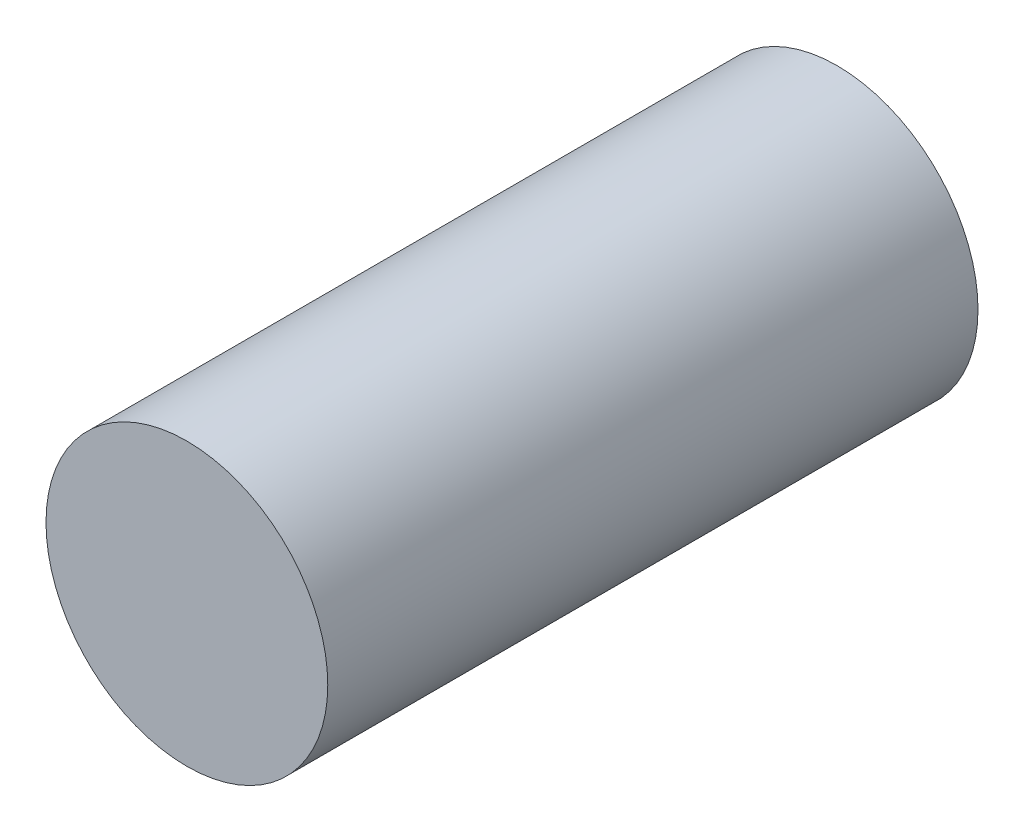
ISO-10303-21;
HEADER;
FILE_DESCRIPTION(('STEP AP214'),'2;1');
FILE_NAME('part.step','',(''),(''),'','','');
FILE_SCHEMA(('AUTOMOTIVE_DESIGN { 1 0 10303 214 1 1 1 1 }'));
ENDSEC;
DATA;
#1=APPLICATION_CONTEXT('core data for automotive mechanical design processes');
#2=APPLICATION_PROTOCOL_DEFINITION('international standard','automotive_design',2000,#1);
#3=PRODUCT_CONTEXT('',#1,'mechanical');
#4=PRODUCT('Part','Part','',(#3));
#5=PRODUCT_RELATED_PRODUCT_CATEGORY('part','',(#4));
#6=PRODUCT_DEFINITION_FORMATION('','',#4);
#7=PRODUCT_DEFINITION_CONTEXT('part definition',#1,'design');
#8=PRODUCT_DEFINITION('design','',#6,#7);
#9=PRODUCT_DEFINITION_SHAPE('','',#8);
#10=(LENGTH_UNIT() NAMED_UNIT(*) SI_UNIT(.MILLI.,.METRE.));
#11=(NAMED_UNIT(*) PLANE_ANGLE_UNIT() SI_UNIT($,.RADIAN.));
#12=(NAMED_UNIT(*) SI_UNIT($,.STERADIAN.) SOLID_ANGLE_UNIT());
#13=UNCERTAINTY_MEASURE_WITH_UNIT(LENGTH_MEASURE(1.E-05),#10,'distance_accuracy_value','');
#14=(GEOMETRIC_REPRESENTATION_CONTEXT(3) GLOBAL_UNCERTAINTY_ASSIGNED_CONTEXT((#13)) GLOBAL_UNIT_ASSIGNED_CONTEXT((#10,
#11,#12)) REPRESENTATION_CONTEXT('',''));
#15=CARTESIAN_POINT('',(0.,0.,0.));
#16=DIRECTION('',(0.,0.,1.));
#17=DIRECTION('',(1.,0.,0.));
#18=AXIS2_PLACEMENT_3D('',#15,#16,#17);
#19=CARTESIAN_POINT('',(0.,0.,30.));
#20=DIRECTION('',(0.,0.,-1.));
#21=DIRECTION('',(-1.,0.,0.));
#22=AXIS2_PLACEMENT_3D('',#19,#20,#21);
#23=CYLINDRICAL_SURFACE('',#22,6.5);
#24=CARTESIAN_POINT('',(0.,0.,30.));
#25=DIRECTION('',(0.,0.,1.));
#26=DIRECTION('',(1.,0.,0.));
#27=AXIS2_PLACEMENT_3D('',#24,#25,#26);
#28=CIRCLE('',#27,6.5);
#29=CARTESIAN_POINT('',(6.5,0.,30.));
#30=VERTEX_POINT('',#29);
#31=EDGE_CURVE('E10',#30,#30,#28,.T.);
#32=ORIENTED_EDGE('',*,*,#31,.F.);
#33=EDGE_LOOP('',(#32));
#34=FACE_BOUND('',#33,.T.);
#35=CARTESIAN_POINT('',(0.,0.,0.));
#36=DIRECTION('',(0.,0.,1.));
#37=DIRECTION('',(1.,0.,0.));
#38=AXIS2_PLACEMENT_3D('',#35,#36,#37);
#39=CIRCLE('',#38,6.5);
#40=CARTESIAN_POINT('',(6.5,0.,0.));
#41=VERTEX_POINT('',#40);
#42=EDGE_CURVE('E34',#41,#41,#39,.T.);
#43=ORIENTED_EDGE('',*,*,#42,.T.);
#44=EDGE_LOOP('',(#43));
#45=FACE_BOUND('',#44,.T.);
#46=ADVANCED_FACE('F31',(#34,#45),#23,.T.);
#47=CARTESIAN_POINT('',(0.,0.,30.));
#48=DIRECTION('',(0.,0.,1.));
#49=DIRECTION('',(1.,0.,0.));
#50=AXIS2_PLACEMENT_3D('',#47,#48,#49);
#51=PLANE('',#50);
#52=ORIENTED_EDGE('',*,*,#31,.T.);
#53=EDGE_LOOP('',(#52));
#54=FACE_BOUND('',#53,.T.);
#55=ADVANCED_FACE('F46',(#54),#51,.T.);
#56=CARTESIAN_POINT('',(0.,0.,0.));
#57=DIRECTION('',(0.,0.,1.));
#58=DIRECTION('',(1.,0.,0.));
#59=AXIS2_PLACEMENT_3D('',#56,#57,#58);
#60=PLANE('',#59);
#61=ORIENTED_EDGE('',*,*,#42,.F.);
#62=EDGE_LOOP('',(#61));
#63=FACE_BOUND('',#62,.T.);
#64=ADVANCED_FACE('F44',(#63),#60,.F.);
#65=CLOSED_SHELL('',(#46,#55,#64));
#66=MANIFOLD_SOLID_BREP('B2',#65);
#67=ADVANCED_BREP_SHAPE_REPRESENTATION('',(#18,#66),#14);
#68=SHAPE_DEFINITION_REPRESENTATION(#9,#67);
ENDSEC;
END-ISO-10303-21;
